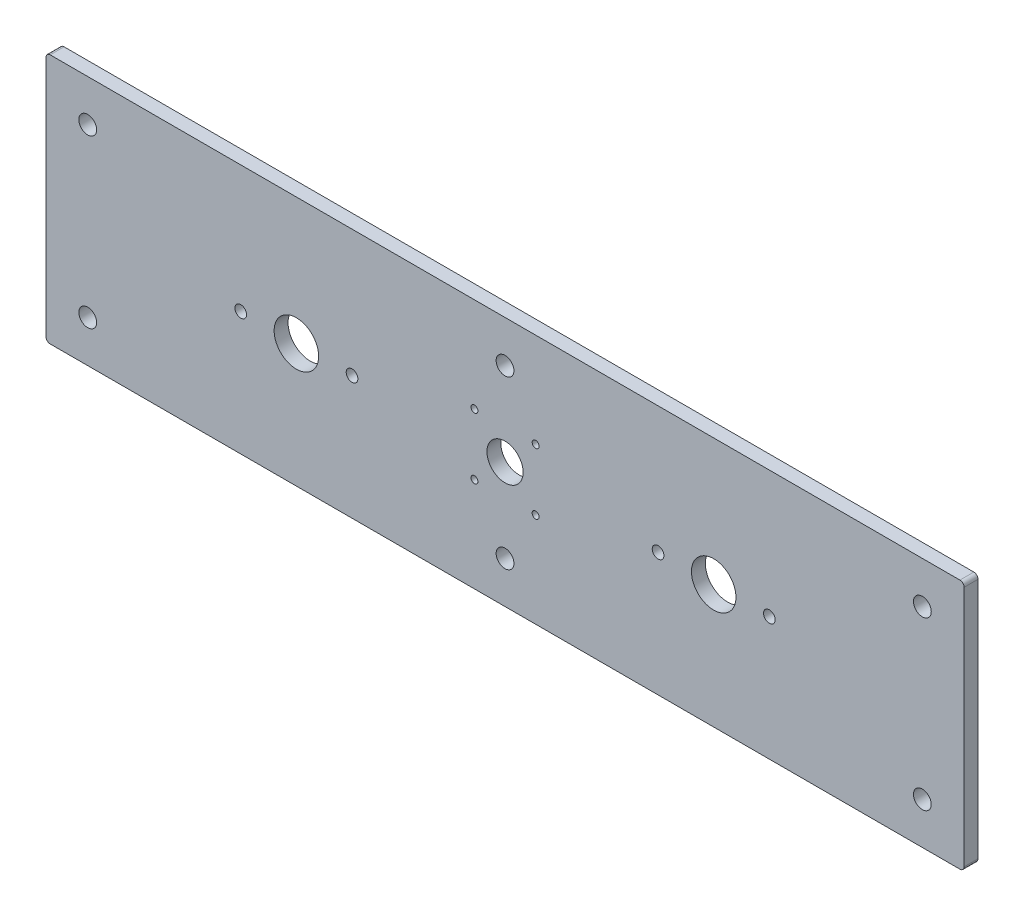
ISO-10303-21;
HEADER;
FILE_DESCRIPTION(('STEP AP214'),'2;1');
FILE_NAME('part.step','',(''),(''),'','','');
FILE_SCHEMA(('AUTOMOTIVE_DESIGN { 1 0 10303 214 1 1 1 1 }'));
ENDSEC;
DATA;
#1=APPLICATION_CONTEXT('core data for automotive mechanical design processes');
#2=APPLICATION_PROTOCOL_DEFINITION('international standard','automotive_design',2000,#1);
#3=PRODUCT_CONTEXT('',#1,'mechanical');
#4=PRODUCT('Part','Part','',(#3));
#5=PRODUCT_RELATED_PRODUCT_CATEGORY('part','',(#4));
#6=PRODUCT_DEFINITION_FORMATION('','',#4);
#7=PRODUCT_DEFINITION_CONTEXT('part definition',#1,'design');
#8=PRODUCT_DEFINITION('design','',#6,#7);
#9=PRODUCT_DEFINITION_SHAPE('','',#8);
#10=(LENGTH_UNIT() NAMED_UNIT(*) SI_UNIT(.MILLI.,.METRE.));
#11=(NAMED_UNIT(*) PLANE_ANGLE_UNIT() SI_UNIT($,.RADIAN.));
#12=(NAMED_UNIT(*) SI_UNIT($,.STERADIAN.) SOLID_ANGLE_UNIT());
#13=UNCERTAINTY_MEASURE_WITH_UNIT(LENGTH_MEASURE(1.E-05),#10,'distance_accuracy_value','');
#14=(GEOMETRIC_REPRESENTATION_CONTEXT(3) GLOBAL_UNCERTAINTY_ASSIGNED_CONTEXT((#13)) GLOBAL_UNIT_ASSIGNED_CONTEXT((#10,
#11,#12)) REPRESENTATION_CONTEXT('',''));
#15=CARTESIAN_POINT('',(0.,0.,0.));
#16=DIRECTION('',(0.,0.,1.));
#17=DIRECTION('',(1.,0.,0.));
#18=AXIS2_PLACEMENT_3D('',#15,#16,#17);
#19=CARTESIAN_POINT('',(0.,0.,2.5));
#20=DIRECTION('',(0.,0.,-1.));
#21=DIRECTION('',(-1.,0.,0.));
#22=AXIS2_PLACEMENT_3D('',#19,#20,#21);
#23=PLANE('',#22);
#24=CARTESIAN_POINT('',(11.,11.,2.5));
#25=DIRECTION('',(0.,0.,1.));
#26=DIRECTION('',(1.,0.,0.));
#27=AXIS2_PLACEMENT_3D('',#24,#25,#26);
#28=CIRCLE('',#27,1.25);
#29=CARTESIAN_POINT('',(12.25,11.,2.5));
#30=VERTEX_POINT('',#29);
#31=EDGE_CURVE('E274',#30,#30,#28,.T.);
#32=ORIENTED_EDGE('',*,*,#31,.F.);
#33=EDGE_LOOP('',(#32));
#34=FACE_BOUND('',#33,.T.);
#35=CARTESIAN_POINT('',(-11.,-11.,2.5));
#36=DIRECTION('',(0.,0.,1.));
#37=DIRECTION('',(1.,0.,0.));
#38=AXIS2_PLACEMENT_3D('',#35,#36,#37);
#39=CIRCLE('',#38,1.25);
#40=CARTESIAN_POINT('',(-9.75,-11.,2.5));
#41=VERTEX_POINT('',#40);
#42=EDGE_CURVE('E268',#41,#41,#39,.T.);
#43=ORIENTED_EDGE('',*,*,#42,.F.);
#44=EDGE_LOOP('',(#43));
#45=FACE_BOUND('',#44,.T.);
#46=CARTESIAN_POINT('',(-11.,11.,2.5));
#47=DIRECTION('',(0.,0.,1.));
#48=DIRECTION('',(1.,0.,0.));
#49=AXIS2_PLACEMENT_3D('',#46,#47,#48);
#50=CIRCLE('',#49,1.25);
#51=CARTESIAN_POINT('',(-9.75,11.,2.5));
#52=VERTEX_POINT('',#51);
#53=EDGE_CURVE('E262',#52,#52,#50,.T.);
#54=ORIENTED_EDGE('',*,*,#53,.F.);
#55=EDGE_LOOP('',(#54));
#56=FACE_BOUND('',#55,.T.);
#57=CARTESIAN_POINT('',(11.,-11.,2.5));
#58=DIRECTION('',(0.,0.,1.));
#59=DIRECTION('',(1.,0.,0.));
#60=AXIS2_PLACEMENT_3D('',#57,#58,#59);
#61=CIRCLE('',#60,1.25);
#62=CARTESIAN_POINT('',(12.25,-11.,2.5));
#63=VERTEX_POINT('',#62);
#64=EDGE_CURVE('E256',#63,#63,#61,.T.);
#65=ORIENTED_EDGE('',*,*,#64,.F.);
#66=EDGE_LOOP('',(#65));
#67=FACE_BOUND('',#66,.T.);
#68=CARTESIAN_POINT('',(0.,0.,2.5));
#69=DIRECTION('',(0.,0.,1.));
#70=DIRECTION('',(1.,0.,0.));
#71=AXIS2_PLACEMENT_3D('',#68,#69,#70);
#72=CIRCLE('',#71,6.5);
#73=CARTESIAN_POINT('',(6.5,0.,2.5));
#74=VERTEX_POINT('',#73);
#75=EDGE_CURVE('E248',#74,#74,#72,.T.);
#76=ORIENTED_EDGE('',*,*,#75,.F.);
#77=EDGE_LOOP('',(#76));
#78=FACE_BOUND('',#77,.T.);
#79=CARTESIAN_POINT('',(95.,-0.6,2.5));
#80=DIRECTION('',(0.,0.,1.));
#81=DIRECTION('',(1.,0.,0.));
#82=AXIS2_PLACEMENT_3D('',#79,#80,#81);
#83=CIRCLE('',#82,2.09999999999999);
#84=CARTESIAN_POINT('',(97.1,-0.6,2.5));
#85=VERTEX_POINT('',#84);
#86=EDGE_CURVE('E244',#85,#85,#83,.T.);
#87=ORIENTED_EDGE('',*,*,#86,.F.);
#88=EDGE_LOOP('',(#87));
#89=FACE_BOUND('',#88,.T.);
#90=CARTESIAN_POINT('',(55.,-0.6,2.5));
#91=DIRECTION('',(0.,0.,1.));
#92=DIRECTION('',(1.,0.,0.));
#93=AXIS2_PLACEMENT_3D('',#90,#91,#92);
#94=CIRCLE('',#93,2.1);
#95=CARTESIAN_POINT('',(57.1,-0.6,2.5));
#96=VERTEX_POINT('',#95);
#97=EDGE_CURVE('E238',#96,#96,#94,.T.);
#98=ORIENTED_EDGE('',*,*,#97,.F.);
#99=EDGE_LOOP('',(#98));
#100=FACE_BOUND('',#99,.T.);
#101=DIRECTION('',(0.,-1.,0.));
#102=VECTOR('',#101,1.);
#103=CARTESIAN_POINT('',(-165.,-45.,2.5));
#104=LINE('',#103,#102);
#105=CARTESIAN_POINT('',(-165.,43.5,2.5));
#106=VERTEX_POINT('',#105);
#107=CARTESIAN_POINT('',(-165.,-43.5,2.5));
#108=VERTEX_POINT('',#107);
#109=EDGE_CURVE('E196',#106,#108,#104,.T.);
#110=ORIENTED_EDGE('',*,*,#109,.T.);
#111=CARTESIAN_POINT('',(-163.5,-43.5,2.5));
#112=DIRECTION('',(0.,0.,-1.));
#113=DIRECTION('',(-1.,0.,0.));
#114=AXIS2_PLACEMENT_3D('',#111,#112,#113);
#115=CIRCLE('',#114,1.5);
#116=CARTESIAN_POINT('',(-163.5,-45.,2.5));
#117=VERTEX_POINT('',#116);
#118=EDGE_CURVE('E175',#108,#117,#115,.F.);
#119=ORIENTED_EDGE('',*,*,#118,.T.);
#120=DIRECTION('',(1.,0.,0.));
#121=VECTOR('',#120,1.);
#122=CARTESIAN_POINT('',(-165.,-45.,2.5));
#123=LINE('',#122,#121);
#124=CARTESIAN_POINT('',(163.5,-45.,2.5));
#125=VERTEX_POINT('',#124);
#126=EDGE_CURVE('E121',#117,#125,#123,.T.);
#127=ORIENTED_EDGE('',*,*,#126,.T.);
#128=CARTESIAN_POINT('',(163.5,-43.5,2.5));
#129=DIRECTION('',(0.,0.,-1.));
#130=DIRECTION('',(-1.,0.,0.));
#131=AXIS2_PLACEMENT_3D('',#128,#129,#130);
#132=CIRCLE('',#131,1.5);
#133=CARTESIAN_POINT('',(165.,-43.5,2.5));
#134=VERTEX_POINT('',#133);
#135=EDGE_CURVE('E171',#125,#134,#132,.F.);
#136=ORIENTED_EDGE('',*,*,#135,.T.);
#137=DIRECTION('',(0.,1.,0.));
#138=VECTOR('',#137,1.);
#139=CARTESIAN_POINT('',(165.,-45.,2.5));
#140=LINE('',#139,#138);
#141=CARTESIAN_POINT('',(165.,43.5,2.5));
#142=VERTEX_POINT('',#141);
#143=EDGE_CURVE('E129',#134,#142,#140,.T.);
#144=ORIENTED_EDGE('',*,*,#143,.T.);
#145=CARTESIAN_POINT('',(163.5,43.5,2.5));
#146=DIRECTION('',(0.,0.,-1.));
#147=DIRECTION('',(-1.,0.,0.));
#148=AXIS2_PLACEMENT_3D('',#145,#146,#147);
#149=CIRCLE('',#148,1.5);
#150=CARTESIAN_POINT('',(163.5,45.,2.5));
#151=VERTEX_POINT('',#150);
#152=EDGE_CURVE('E56',#142,#151,#149,.F.);
#153=ORIENTED_EDGE('',*,*,#152,.T.);
#154=DIRECTION('',(-1.,0.,0.));
#155=VECTOR('',#154,1.);
#156=CARTESIAN_POINT('',(-165.,45.,2.5));
#157=LINE('',#156,#155);
#158=CARTESIAN_POINT('',(-163.5,45.,2.5));
#159=VERTEX_POINT('',#158);
#160=EDGE_CURVE('E132',#151,#159,#157,.T.);
#161=ORIENTED_EDGE('',*,*,#160,.T.);
#162=CARTESIAN_POINT('',(-163.5,43.5,2.5));
#163=DIRECTION('',(0.,0.,-1.));
#164=DIRECTION('',(-1.,0.,0.));
#165=AXIS2_PLACEMENT_3D('',#162,#163,#164);
#166=CIRCLE('',#165,1.5);
#167=EDGE_CURVE('E173',#159,#106,#166,.F.);
#168=ORIENTED_EDGE('',*,*,#167,.T.);
#169=EDGE_LOOP('',(#110,#119,#127,#136,#144,#153,#161,#168));
#170=FACE_BOUND('',#169,.T.);
#171=CARTESIAN_POINT('',(150.000000000003,30.0000000000006,2.5));
#172=DIRECTION('',(0.,0.,1.));
#173=DIRECTION('',(1.,0.,0.));
#174=AXIS2_PLACEMENT_3D('',#171,#172,#173);
#175=CIRCLE('',#174,3.19999999999998);
#176=CARTESIAN_POINT('',(153.200000000003,30.0000000000006,2.5));
#177=VERTEX_POINT('',#176);
#178=EDGE_CURVE('E142',#177,#177,#175,.T.);
#179=ORIENTED_EDGE('',*,*,#178,.F.);
#180=EDGE_LOOP('',(#179));
#181=FACE_BOUND('',#180,.T.);
#182=CARTESIAN_POINT('',(150.000000000003,-30.0000000000006,2.5));
#183=DIRECTION('',(0.,0.,1.));
#184=DIRECTION('',(1.,0.,0.));
#185=AXIS2_PLACEMENT_3D('',#182,#183,#184);
#186=CIRCLE('',#185,3.19999999999998);
#187=CARTESIAN_POINT('',(153.200000000003,-30.0000000000006,2.5));
#188=VERTEX_POINT('',#187);
#189=EDGE_CURVE('E146',#188,#188,#186,.T.);
#190=ORIENTED_EDGE('',*,*,#189,.F.);
#191=EDGE_LOOP('',(#190));
#192=FACE_BOUND('',#191,.T.);
#193=CARTESIAN_POINT('',(0.,-30.0000000000006,2.5));
#194=DIRECTION('',(0.,0.,1.));
#195=DIRECTION('',(1.,0.,0.));
#196=AXIS2_PLACEMENT_3D('',#193,#194,#195);
#197=CIRCLE('',#196,3.19999999999999);
#198=CARTESIAN_POINT('',(3.20000000000004,-30.0000000000006,2.5));
#199=VERTEX_POINT('',#198);
#200=EDGE_CURVE('E150',#199,#199,#197,.T.);
#201=ORIENTED_EDGE('',*,*,#200,.F.);
#202=EDGE_LOOP('',(#201));
#203=FACE_BOUND('',#202,.T.);
#204=CARTESIAN_POINT('',(0.,30.0000000000006,2.5));
#205=DIRECTION('',(0.,0.,1.));
#206=DIRECTION('',(1.,0.,0.));
#207=AXIS2_PLACEMENT_3D('',#204,#205,#206);
#208=CIRCLE('',#207,3.19999999999999);
#209=CARTESIAN_POINT('',(3.19999999999994,30.0000000000006,2.5));
#210=VERTEX_POINT('',#209);
#211=EDGE_CURVE('E154',#210,#210,#208,.T.);
#212=ORIENTED_EDGE('',*,*,#211,.F.);
#213=EDGE_LOOP('',(#212));
#214=FACE_BOUND('',#213,.T.);
#215=CARTESIAN_POINT('',(-150.000000000003,-30.0000000000006,2.5));
#216=DIRECTION('',(0.,0.,1.));
#217=DIRECTION('',(1.,0.,0.));
#218=AXIS2_PLACEMENT_3D('',#215,#216,#217);
#219=CIRCLE('',#218,3.19999999999998);
#220=CARTESIAN_POINT('',(-146.800000000003,-30.0000000000006,2.5));
#221=VERTEX_POINT('',#220);
#222=EDGE_CURVE('E158',#221,#221,#219,.T.);
#223=ORIENTED_EDGE('',*,*,#222,.F.);
#224=EDGE_LOOP('',(#223));
#225=FACE_BOUND('',#224,.T.);
#226=CARTESIAN_POINT('',(-150.000000000003,30.0000000000006,2.5));
#227=DIRECTION('',(0.,0.,1.));
#228=DIRECTION('',(1.,0.,0.));
#229=AXIS2_PLACEMENT_3D('',#226,#227,#228);
#230=CIRCLE('',#229,3.19999999999998);
#231=CARTESIAN_POINT('',(-146.800000000003,30.0000000000006,2.5));
#232=VERTEX_POINT('',#231);
#233=EDGE_CURVE('E162',#232,#232,#230,.T.);
#234=ORIENTED_EDGE('',*,*,#233,.F.);
#235=EDGE_LOOP('',(#234));
#236=FACE_BOUND('',#235,.T.);
#237=CARTESIAN_POINT('',(-75.,-0.6,2.5));
#238=DIRECTION('',(0.,0.,1.));
#239=DIRECTION('',(1.,0.,0.));
#240=AXIS2_PLACEMENT_3D('',#237,#238,#239);
#241=CIRCLE('',#240,8.);
#242=CARTESIAN_POINT('',(-67.,-0.6,2.5));
#243=VERTEX_POINT('',#242);
#244=EDGE_CURVE('E212',#243,#243,#241,.T.);
#245=ORIENTED_EDGE('',*,*,#244,.F.);
#246=EDGE_LOOP('',(#245));
#247=FACE_BOUND('',#246,.T.);
#248=CARTESIAN_POINT('',(-55.,-0.6,2.5));
#249=DIRECTION('',(0.,0.,1.));
#250=DIRECTION('',(1.,0.,0.));
#251=AXIS2_PLACEMENT_3D('',#248,#249,#250);
#252=CIRCLE('',#251,2.1);
#253=CARTESIAN_POINT('',(-52.9,-0.6,2.5));
#254=VERTEX_POINT('',#253);
#255=EDGE_CURVE('E220',#254,#254,#252,.T.);
#256=ORIENTED_EDGE('',*,*,#255,.F.);
#257=EDGE_LOOP('',(#256));
#258=FACE_BOUND('',#257,.T.);
#259=CARTESIAN_POINT('',(-95.,-0.6,2.5));
#260=DIRECTION('',(0.,0.,1.));
#261=DIRECTION('',(1.,0.,0.));
#262=AXIS2_PLACEMENT_3D('',#259,#260,#261);
#263=CIRCLE('',#262,2.09999999999999);
#264=CARTESIAN_POINT('',(-92.9,-0.6,2.5));
#265=VERTEX_POINT('',#264);
#266=EDGE_CURVE('E226',#265,#265,#263,.T.);
#267=ORIENTED_EDGE('',*,*,#266,.F.);
#268=EDGE_LOOP('',(#267));
#269=FACE_BOUND('',#268,.T.);
#270=CARTESIAN_POINT('',(75.,-0.6,2.5));
#271=DIRECTION('',(0.,0.,-1.));
#272=DIRECTION('',(-1.,0.,0.));
#273=AXIS2_PLACEMENT_3D('',#270,#271,#272);
#274=CIRCLE('',#273,8.);
#275=CARTESIAN_POINT('',(67.,-0.6,2.5));
#276=VERTEX_POINT('',#275);
#277=EDGE_CURVE('E230',#276,#276,#274,.T.);
#278=ORIENTED_EDGE('',*,*,#277,.T.);
#279=EDGE_LOOP('',(#278));
#280=FACE_BOUND('',#279,.T.);
#281=ADVANCED_FACE('F34',(#34,#45,#56,#67,#78,#89,#100,#170,#181,#192,#203,#214,#225,#236,#247,
#258,#269,#280),#23,.F.);
#282=CARTESIAN_POINT('',(0.,0.,-2.5));
#283=DIRECTION('',(0.,0.,-1.));
#284=DIRECTION('',(-1.,0.,0.));
#285=AXIS2_PLACEMENT_3D('',#282,#283,#284);
#286=PLANE('',#285);
#287=CARTESIAN_POINT('',(11.,11.,-2.5));
#288=DIRECTION('',(0.,0.,1.));
#289=DIRECTION('',(1.,0.,0.));
#290=AXIS2_PLACEMENT_3D('',#287,#288,#289);
#291=CIRCLE('',#290,1.25);
#292=CARTESIAN_POINT('',(12.25,11.,-2.5));
#293=VERTEX_POINT('',#292);
#294=EDGE_CURVE('E271',#293,#293,#291,.T.);
#295=ORIENTED_EDGE('',*,*,#294,.T.);
#296=EDGE_LOOP('',(#295));
#297=FACE_BOUND('',#296,.T.);
#298=CARTESIAN_POINT('',(-11.,-11.,-2.5));
#299=DIRECTION('',(0.,0.,1.));
#300=DIRECTION('',(1.,0.,0.));
#301=AXIS2_PLACEMENT_3D('',#298,#299,#300);
#302=CIRCLE('',#301,1.25);
#303=CARTESIAN_POINT('',(-9.75,-11.,-2.5));
#304=VERTEX_POINT('',#303);
#305=EDGE_CURVE('E265',#304,#304,#302,.T.);
#306=ORIENTED_EDGE('',*,*,#305,.T.);
#307=EDGE_LOOP('',(#306));
#308=FACE_BOUND('',#307,.T.);
#309=CARTESIAN_POINT('',(-11.,11.,-2.5));
#310=DIRECTION('',(0.,0.,1.));
#311=DIRECTION('',(1.,0.,0.));
#312=AXIS2_PLACEMENT_3D('',#309,#310,#311);
#313=CIRCLE('',#312,1.25);
#314=CARTESIAN_POINT('',(-9.75,11.,-2.5));
#315=VERTEX_POINT('',#314);
#316=EDGE_CURVE('E259',#315,#315,#313,.T.);
#317=ORIENTED_EDGE('',*,*,#316,.T.);
#318=EDGE_LOOP('',(#317));
#319=FACE_BOUND('',#318,.T.);
#320=CARTESIAN_POINT('',(11.,-11.,-2.5));
#321=DIRECTION('',(0.,0.,1.));
#322=DIRECTION('',(1.,0.,0.));
#323=AXIS2_PLACEMENT_3D('',#320,#321,#322);
#324=CIRCLE('',#323,1.25);
#325=CARTESIAN_POINT('',(12.25,-11.,-2.5));
#326=VERTEX_POINT('',#325);
#327=EDGE_CURVE('E251',#326,#326,#324,.T.);
#328=ORIENTED_EDGE('',*,*,#327,.T.);
#329=EDGE_LOOP('',(#328));
#330=FACE_BOUND('',#329,.T.);
#331=CARTESIAN_POINT('',(0.,0.,-2.5));
#332=DIRECTION('',(0.,0.,1.));
#333=DIRECTION('',(1.,0.,0.));
#334=AXIS2_PLACEMENT_3D('',#331,#332,#333);
#335=CIRCLE('',#334,6.5);
#336=CARTESIAN_POINT('',(6.5,0.,-2.5));
#337=VERTEX_POINT('',#336);
#338=EDGE_CURVE('E247',#337,#337,#335,.T.);
#339=ORIENTED_EDGE('',*,*,#338,.T.);
#340=EDGE_LOOP('',(#339));
#341=FACE_BOUND('',#340,.T.);
#342=CARTESIAN_POINT('',(95.,-0.6,-2.5));
#343=DIRECTION('',(0.,0.,1.));
#344=DIRECTION('',(1.,0.,0.));
#345=AXIS2_PLACEMENT_3D('',#342,#343,#344);
#346=CIRCLE('',#345,2.09999999999999);
#347=CARTESIAN_POINT('',(97.1,-0.6,-2.5));
#348=VERTEX_POINT('',#347);
#349=EDGE_CURVE('E241',#348,#348,#346,.T.);
#350=ORIENTED_EDGE('',*,*,#349,.T.);
#351=EDGE_LOOP('',(#350));
#352=FACE_BOUND('',#351,.T.);
#353=CARTESIAN_POINT('',(55.,-0.6,-2.5));
#354=DIRECTION('',(0.,0.,1.));
#355=DIRECTION('',(1.,0.,0.));
#356=AXIS2_PLACEMENT_3D('',#353,#354,#355);
#357=CIRCLE('',#356,2.1);
#358=CARTESIAN_POINT('',(57.1,-0.6,-2.5));
#359=VERTEX_POINT('',#358);
#360=EDGE_CURVE('E233',#359,#359,#357,.T.);
#361=ORIENTED_EDGE('',*,*,#360,.T.);
#362=EDGE_LOOP('',(#361));
#363=FACE_BOUND('',#362,.T.);
#364=DIRECTION('',(1.,0.,0.));
#365=VECTOR('',#364,1.);
#366=CARTESIAN_POINT('',(-165.,-45.,-2.5));
#367=LINE('',#366,#365);
#368=CARTESIAN_POINT('',(-163.5,-45.,-2.5));
#369=VERTEX_POINT('',#368);
#370=CARTESIAN_POINT('',(163.5,-45.,-2.5));
#371=VERTEX_POINT('',#370);
#372=EDGE_CURVE('E118',#369,#371,#367,.T.);
#373=ORIENTED_EDGE('',*,*,#372,.F.);
#374=CARTESIAN_POINT('',(-163.5,-43.5,-2.5));
#375=DIRECTION('',(0.,0.,-1.));
#376=DIRECTION('',(-1.,0.,0.));
#377=AXIS2_PLACEMENT_3D('',#374,#375,#376);
#378=CIRCLE('',#377,1.5);
#379=CARTESIAN_POINT('',(-165.,-43.5,-2.5));
#380=VERTEX_POINT('',#379);
#381=EDGE_CURVE('E101',#369,#380,#378,.T.);
#382=ORIENTED_EDGE('',*,*,#381,.T.);
#383=DIRECTION('',(0.,-1.,0.));
#384=VECTOR('',#383,1.);
#385=CARTESIAN_POINT('',(-165.,-45.,-2.5));
#386=LINE('',#385,#384);
#387=CARTESIAN_POINT('',(-165.,43.5,-2.5));
#388=VERTEX_POINT('',#387);
#389=EDGE_CURVE('E130',#388,#380,#386,.T.);
#390=ORIENTED_EDGE('',*,*,#389,.F.);
#391=CARTESIAN_POINT('',(-163.5,43.5,-2.5));
#392=DIRECTION('',(0.,0.,-1.));
#393=DIRECTION('',(-1.,0.,0.));
#394=AXIS2_PLACEMENT_3D('',#391,#392,#393);
#395=CIRCLE('',#394,1.5);
#396=CARTESIAN_POINT('',(-163.5,45.,-2.5));
#397=VERTEX_POINT('',#396);
#398=EDGE_CURVE('E112',#388,#397,#395,.T.);
#399=ORIENTED_EDGE('',*,*,#398,.T.);
#400=DIRECTION('',(-1.,0.,0.));
#401=VECTOR('',#400,1.);
#402=CARTESIAN_POINT('',(-165.,45.,-2.5));
#403=LINE('',#402,#401);
#404=CARTESIAN_POINT('',(163.5,45.,-2.5));
#405=VERTEX_POINT('',#404);
#406=EDGE_CURVE('E134',#405,#397,#403,.T.);
#407=ORIENTED_EDGE('',*,*,#406,.F.);
#408=CARTESIAN_POINT('',(163.5,43.5,-2.5));
#409=DIRECTION('',(0.,0.,-1.));
#410=DIRECTION('',(-1.,0.,0.));
#411=AXIS2_PLACEMENT_3D('',#408,#409,#410);
#412=CIRCLE('',#411,1.5);
#413=CARTESIAN_POINT('',(165.,43.5,-2.5));
#414=VERTEX_POINT('',#413);
#415=EDGE_CURVE('E122',#405,#414,#412,.T.);
#416=ORIENTED_EDGE('',*,*,#415,.T.);
#417=DIRECTION('',(0.,1.,0.));
#418=VECTOR('',#417,1.);
#419=CARTESIAN_POINT('',(165.,-45.,-2.5));
#420=LINE('',#419,#418);
#421=CARTESIAN_POINT('',(165.,-43.5,-2.5));
#422=VERTEX_POINT('',#421);
#423=EDGE_CURVE('E141',#422,#414,#420,.T.);
#424=ORIENTED_EDGE('',*,*,#423,.F.);
#425=CARTESIAN_POINT('',(163.5,-43.5,-2.5));
#426=DIRECTION('',(0.,0.,-1.));
#427=DIRECTION('',(-1.,0.,0.));
#428=AXIS2_PLACEMENT_3D('',#425,#426,#427);
#429=CIRCLE('',#428,1.5);
#430=EDGE_CURVE('E128',#422,#371,#429,.T.);
#431=ORIENTED_EDGE('',*,*,#430,.T.);
#432=EDGE_LOOP('',(#373,#382,#390,#399,#407,#416,#424,#431));
#433=FACE_BOUND('',#432,.T.);
#434=CARTESIAN_POINT('',(150.000000000003,30.0000000000006,-2.5));
#435=DIRECTION('',(0.,0.,-1.));
#436=DIRECTION('',(-1.,0.,0.));
#437=AXIS2_PLACEMENT_3D('',#434,#435,#436);
#438=CIRCLE('',#437,3.19999999999998);
#439=CARTESIAN_POINT('',(146.800000000003,30.0000000000006,-2.5));
#440=VERTEX_POINT('',#439);
#441=EDGE_CURVE('E138',#440,#440,#438,.T.);
#442=ORIENTED_EDGE('',*,*,#441,.F.);
#443=EDGE_LOOP('',(#442));
#444=FACE_BOUND('',#443,.T.);
#445=CARTESIAN_POINT('',(150.000000000003,-30.0000000000006,-2.5));
#446=DIRECTION('',(0.,0.,-1.));
#447=DIRECTION('',(-1.,0.,0.));
#448=AXIS2_PLACEMENT_3D('',#445,#446,#447);
#449=CIRCLE('',#448,3.19999999999998);
#450=CARTESIAN_POINT('',(146.800000000003,-30.0000000000006,-2.5));
#451=VERTEX_POINT('',#450);
#452=EDGE_CURVE('E143',#451,#451,#449,.T.);
#453=ORIENTED_EDGE('',*,*,#452,.F.);
#454=EDGE_LOOP('',(#453));
#455=FACE_BOUND('',#454,.T.);
#456=CARTESIAN_POINT('',(0.,-30.0000000000006,-2.5));
#457=DIRECTION('',(0.,0.,-1.));
#458=DIRECTION('',(-1.,0.,0.));
#459=AXIS2_PLACEMENT_3D('',#456,#457,#458);
#460=CIRCLE('',#459,3.19999999999999);
#461=CARTESIAN_POINT('',(-3.19999999999994,-30.0000000000006,-2.5));
#462=VERTEX_POINT('',#461);
#463=EDGE_CURVE('E147',#462,#462,#460,.T.);
#464=ORIENTED_EDGE('',*,*,#463,.F.);
#465=EDGE_LOOP('',(#464));
#466=FACE_BOUND('',#465,.T.);
#467=CARTESIAN_POINT('',(0.,30.0000000000006,-2.5));
#468=DIRECTION('',(0.,0.,-1.));
#469=DIRECTION('',(-1.,0.,0.));
#470=AXIS2_PLACEMENT_3D('',#467,#468,#469);
#471=CIRCLE('',#470,3.19999999999999);
#472=CARTESIAN_POINT('',(-3.20000000000004,30.0000000000006,-2.5));
#473=VERTEX_POINT('',#472);
#474=EDGE_CURVE('E151',#473,#473,#471,.T.);
#475=ORIENTED_EDGE('',*,*,#474,.F.);
#476=EDGE_LOOP('',(#475));
#477=FACE_BOUND('',#476,.T.);
#478=CARTESIAN_POINT('',(-150.000000000003,-30.0000000000006,-2.5));
#479=DIRECTION('',(0.,0.,-1.));
#480=DIRECTION('',(-1.,0.,0.));
#481=AXIS2_PLACEMENT_3D('',#478,#479,#480);
#482=CIRCLE('',#481,3.19999999999998);
#483=CARTESIAN_POINT('',(-153.200000000003,-30.0000000000006,-2.5));
#484=VERTEX_POINT('',#483);
#485=EDGE_CURVE('E155',#484,#484,#482,.T.);
#486=ORIENTED_EDGE('',*,*,#485,.F.);
#487=EDGE_LOOP('',(#486));
#488=FACE_BOUND('',#487,.T.);
#489=CARTESIAN_POINT('',(-150.000000000003,30.0000000000006,-2.5));
#490=DIRECTION('',(0.,0.,-1.));
#491=DIRECTION('',(-1.,0.,0.));
#492=AXIS2_PLACEMENT_3D('',#489,#490,#491);
#493=CIRCLE('',#492,3.19999999999998);
#494=CARTESIAN_POINT('',(-153.200000000003,30.0000000000006,-2.5));
#495=VERTEX_POINT('',#494);
#496=EDGE_CURVE('E159',#495,#495,#493,.T.);
#497=ORIENTED_EDGE('',*,*,#496,.F.);
#498=EDGE_LOOP('',(#497));
#499=FACE_BOUND('',#498,.T.);
#500=CARTESIAN_POINT('',(-75.,-0.6,-2.5));
#501=DIRECTION('',(0.,0.,1.));
#502=DIRECTION('',(1.,0.,0.));
#503=AXIS2_PLACEMENT_3D('',#500,#501,#502);
#504=CIRCLE('',#503,8.);
#505=CARTESIAN_POINT('',(-67.,-0.6,-2.5));
#506=VERTEX_POINT('',#505);
#507=EDGE_CURVE('E211',#506,#506,#504,.T.);
#508=ORIENTED_EDGE('',*,*,#507,.T.);
#509=EDGE_LOOP('',(#508));
#510=FACE_BOUND('',#509,.T.);
#511=CARTESIAN_POINT('',(-55.,-0.6,-2.5));
#512=DIRECTION('',(0.,0.,1.));
#513=DIRECTION('',(1.,0.,0.));
#514=AXIS2_PLACEMENT_3D('',#511,#512,#513);
#515=CIRCLE('',#514,2.1);
#516=CARTESIAN_POINT('',(-52.9,-0.6,-2.5));
#517=VERTEX_POINT('',#516);
#518=EDGE_CURVE('E215',#517,#517,#515,.T.);
#519=ORIENTED_EDGE('',*,*,#518,.T.);
#520=EDGE_LOOP('',(#519));
#521=FACE_BOUND('',#520,.T.);
#522=CARTESIAN_POINT('',(-95.,-0.6,-2.5));
#523=DIRECTION('',(0.,0.,1.));
#524=DIRECTION('',(1.,0.,0.));
#525=AXIS2_PLACEMENT_3D('',#522,#523,#524);
#526=CIRCLE('',#525,2.09999999999999);
#527=CARTESIAN_POINT('',(-92.9,-0.6,-2.5));
#528=VERTEX_POINT('',#527);
#529=EDGE_CURVE('E223',#528,#528,#526,.T.);
#530=ORIENTED_EDGE('',*,*,#529,.T.);
#531=EDGE_LOOP('',(#530));
#532=FACE_BOUND('',#531,.T.);
#533=CARTESIAN_POINT('',(75.,-0.6,-2.5));
#534=DIRECTION('',(0.,0.,-1.));
#535=DIRECTION('',(-1.,0.,0.));
#536=AXIS2_PLACEMENT_3D('',#533,#534,#535);
#537=CIRCLE('',#536,8.);
#538=CARTESIAN_POINT('',(67.,-0.6,-2.5));
#539=VERTEX_POINT('',#538);
#540=EDGE_CURVE('E229',#539,#539,#537,.T.);
#541=ORIENTED_EDGE('',*,*,#540,.F.);
#542=EDGE_LOOP('',(#541));
#543=FACE_BOUND('',#542,.T.);
#544=ADVANCED_FACE('F125',(#297,#308,#319,#330,#341,#352,#363,#433,#444,#455,#466,#477,#488,
#499,#510,#521,#532,#543),#286,.T.);
#545=CARTESIAN_POINT('',(165.,-45.,2.5));
#546=DIRECTION('',(-1.,0.,0.));
#547=DIRECTION('',(0.,0.,1.));
#548=AXIS2_PLACEMENT_3D('',#545,#546,#547);
#549=PLANE('',#548);
#550=ORIENTED_EDGE('',*,*,#143,.F.);
#551=DIRECTION('',(0.,0.,-1.));
#552=VECTOR('',#551,1.);
#553=CARTESIAN_POINT('',(165.,-43.5,2.5));
#554=LINE('',#553,#552);
#555=EDGE_CURVE('E11',#134,#422,#554,.T.);
#556=ORIENTED_EDGE('',*,*,#555,.T.);
#557=ORIENTED_EDGE('',*,*,#423,.T.);
#558=DIRECTION('',(0.,0.,-1.));
#559=VECTOR('',#558,1.);
#560=CARTESIAN_POINT('',(165.,43.5,2.5));
#561=LINE('',#560,#559);
#562=EDGE_CURVE('E42',#414,#142,#561,.F.);
#563=ORIENTED_EDGE('',*,*,#562,.T.);
#564=EDGE_LOOP('',(#550,#556,#557,#563));
#565=FACE_BOUND('',#564,.T.);
#566=ADVANCED_FACE('F184',(#565),#549,.F.);
#567=CARTESIAN_POINT('',(-165.,45.,2.5));
#568=DIRECTION('',(0.,-1.,0.));
#569=DIRECTION('',(0.,0.,-1.));
#570=AXIS2_PLACEMENT_3D('',#567,#568,#569);
#571=PLANE('',#570);
#572=ORIENTED_EDGE('',*,*,#406,.T.);
#573=DIRECTION('',(0.,0.,-1.));
#574=VECTOR('',#573,1.);
#575=CARTESIAN_POINT('',(-163.5,45.,2.5));
#576=LINE('',#575,#574);
#577=EDGE_CURVE('E49',#397,#159,#576,.F.);
#578=ORIENTED_EDGE('',*,*,#577,.T.);
#579=ORIENTED_EDGE('',*,*,#160,.F.);
#580=DIRECTION('',(0.,0.,-1.));
#581=VECTOR('',#580,1.);
#582=CARTESIAN_POINT('',(163.5,45.,2.5));
#583=LINE('',#582,#581);
#584=EDGE_CURVE('E177',#151,#405,#583,.T.);
#585=ORIENTED_EDGE('',*,*,#584,.T.);
#586=EDGE_LOOP('',(#572,#578,#579,#585));
#587=FACE_BOUND('',#586,.T.);
#588=ADVANCED_FACE('F192',(#587),#571,.F.);
#589=CARTESIAN_POINT('',(-165.,-45.,2.5));
#590=DIRECTION('',(1.,0.,0.));
#591=DIRECTION('',(0.,0.,-1.));
#592=AXIS2_PLACEMENT_3D('',#589,#590,#591);
#593=PLANE('',#592);
#594=ORIENTED_EDGE('',*,*,#389,.T.);
#595=DIRECTION('',(0.,0.,-1.));
#596=VECTOR('',#595,1.);
#597=CARTESIAN_POINT('',(-165.,-43.5,2.5));
#598=LINE('',#597,#596);
#599=EDGE_CURVE('E106',#380,#108,#598,.F.);
#600=ORIENTED_EDGE('',*,*,#599,.T.);
#601=ORIENTED_EDGE('',*,*,#109,.F.);
#602=DIRECTION('',(0.,0.,-1.));
#603=VECTOR('',#602,1.);
#604=CARTESIAN_POINT('',(-165.,43.5,2.5));
#605=LINE('',#604,#603);
#606=EDGE_CURVE('E111',#106,#388,#605,.T.);
#607=ORIENTED_EDGE('',*,*,#606,.T.);
#608=EDGE_LOOP('',(#594,#600,#601,#607));
#609=FACE_BOUND('',#608,.T.);
#610=ADVANCED_FACE('F354',(#609),#593,.F.);
#611=CARTESIAN_POINT('',(-165.,-45.,2.5));
#612=DIRECTION('',(0.,1.,0.));
#613=DIRECTION('',(0.,0.,1.));
#614=AXIS2_PLACEMENT_3D('',#611,#612,#613);
#615=PLANE('',#614);
#616=ORIENTED_EDGE('',*,*,#126,.F.);
#617=DIRECTION('',(0.,0.,-1.));
#618=VECTOR('',#617,1.);
#619=CARTESIAN_POINT('',(-163.5,-45.,2.5));
#620=LINE('',#619,#618);
#621=EDGE_CURVE('E105',#117,#369,#620,.T.);
#622=ORIENTED_EDGE('',*,*,#621,.T.);
#623=ORIENTED_EDGE('',*,*,#372,.T.);
#624=DIRECTION('',(0.,0.,-1.));
#625=VECTOR('',#624,1.);
#626=CARTESIAN_POINT('',(163.5,-45.,2.5));
#627=LINE('',#626,#625);
#628=EDGE_CURVE('E123',#371,#125,#627,.F.);
#629=ORIENTED_EDGE('',*,*,#628,.T.);
#630=EDGE_LOOP('',(#616,#622,#623,#629));
#631=FACE_BOUND('',#630,.T.);
#632=ADVANCED_FACE('F117',(#631),#615,.F.);
#633=CARTESIAN_POINT('',(150.000000000003,30.0000000000006,2.5));
#634=DIRECTION('',(0.,0.,1.));
#635=DIRECTION('',(1.,0.,0.));
#636=AXIS2_PLACEMENT_3D('',#633,#634,#635);
#637=CYLINDRICAL_SURFACE('',#636,3.19999999999998);
#638=ORIENTED_EDGE('',*,*,#441,.T.);
#639=EDGE_LOOP('',(#638));
#640=FACE_BOUND('',#639,.T.);
#641=ORIENTED_EDGE('',*,*,#178,.T.);
#642=EDGE_LOOP('',(#641));
#643=FACE_BOUND('',#642,.T.);
#644=ADVANCED_FACE('F344',(#640,#643),#637,.F.);
#645=CARTESIAN_POINT('',(150.000000000003,-30.0000000000006,2.5));
#646=DIRECTION('',(0.,0.,1.));
#647=DIRECTION('',(1.,0.,0.));
#648=AXIS2_PLACEMENT_3D('',#645,#646,#647);
#649=CYLINDRICAL_SURFACE('',#648,3.19999999999998);
#650=ORIENTED_EDGE('',*,*,#452,.T.);
#651=EDGE_LOOP('',(#650));
#652=FACE_BOUND('',#651,.T.);
#653=ORIENTED_EDGE('',*,*,#189,.T.);
#654=EDGE_LOOP('',(#653));
#655=FACE_BOUND('',#654,.T.);
#656=ADVANCED_FACE('F340',(#652,#655),#649,.F.);
#657=CARTESIAN_POINT('',(0.,-30.0000000000006,2.5));
#658=DIRECTION('',(0.,0.,1.));
#659=DIRECTION('',(1.,0.,0.));
#660=AXIS2_PLACEMENT_3D('',#657,#658,#659);
#661=CYLINDRICAL_SURFACE('',#660,3.19999999999999);
#662=ORIENTED_EDGE('',*,*,#463,.T.);
#663=EDGE_LOOP('',(#662));
#664=FACE_BOUND('',#663,.T.);
#665=ORIENTED_EDGE('',*,*,#200,.T.);
#666=EDGE_LOOP('',(#665));
#667=FACE_BOUND('',#666,.T.);
#668=ADVANCED_FACE('F336',(#664,#667),#661,.F.);
#669=CARTESIAN_POINT('',(0.,30.0000000000006,2.5));
#670=DIRECTION('',(0.,0.,1.));
#671=DIRECTION('',(1.,0.,0.));
#672=AXIS2_PLACEMENT_3D('',#669,#670,#671);
#673=CYLINDRICAL_SURFACE('',#672,3.19999999999999);
#674=ORIENTED_EDGE('',*,*,#474,.T.);
#675=EDGE_LOOP('',(#674));
#676=FACE_BOUND('',#675,.T.);
#677=ORIENTED_EDGE('',*,*,#211,.T.);
#678=EDGE_LOOP('',(#677));
#679=FACE_BOUND('',#678,.T.);
#680=ADVANCED_FACE('F332',(#676,#679),#673,.F.);
#681=CARTESIAN_POINT('',(-150.000000000003,-30.0000000000006,2.5));
#682=DIRECTION('',(0.,0.,1.));
#683=DIRECTION('',(1.,0.,0.));
#684=AXIS2_PLACEMENT_3D('',#681,#682,#683);
#685=CYLINDRICAL_SURFACE('',#684,3.19999999999998);
#686=ORIENTED_EDGE('',*,*,#485,.T.);
#687=EDGE_LOOP('',(#686));
#688=FACE_BOUND('',#687,.T.);
#689=ORIENTED_EDGE('',*,*,#222,.T.);
#690=EDGE_LOOP('',(#689));
#691=FACE_BOUND('',#690,.T.);
#692=ADVANCED_FACE('F328',(#688,#691),#685,.F.);
#693=CARTESIAN_POINT('',(-150.000000000003,30.0000000000006,2.5));
#694=DIRECTION('',(0.,0.,1.));
#695=DIRECTION('',(1.,0.,0.));
#696=AXIS2_PLACEMENT_3D('',#693,#694,#695);
#697=CYLINDRICAL_SURFACE('',#696,3.19999999999998);
#698=ORIENTED_EDGE('',*,*,#496,.T.);
#699=EDGE_LOOP('',(#698));
#700=FACE_BOUND('',#699,.T.);
#701=ORIENTED_EDGE('',*,*,#233,.T.);
#702=EDGE_LOOP('',(#701));
#703=FACE_BOUND('',#702,.T.);
#704=ADVANCED_FACE('F324',(#700,#703),#697,.F.);
#705=CARTESIAN_POINT('',(-75.,-0.6,-2.5));
#706=DIRECTION('',(0.,0.,1.));
#707=DIRECTION('',(1.,0.,0.));
#708=AXIS2_PLACEMENT_3D('',#705,#706,#707);
#709=CYLINDRICAL_SURFACE('',#708,8.);
#710=ORIENTED_EDGE('',*,*,#507,.F.);
#711=EDGE_LOOP('',(#710));
#712=FACE_BOUND('',#711,.T.);
#713=ORIENTED_EDGE('',*,*,#244,.T.);
#714=EDGE_LOOP('',(#713));
#715=FACE_BOUND('',#714,.T.);
#716=ADVANCED_FACE('F320',(#712,#715),#709,.F.);
#717=CARTESIAN_POINT('',(-55.,-0.6,2.5));
#718=DIRECTION('',(0.,0.,1.));
#719=DIRECTION('',(1.,0.,0.));
#720=AXIS2_PLACEMENT_3D('',#717,#718,#719);
#721=CYLINDRICAL_SURFACE('',#720,2.1);
#722=ORIENTED_EDGE('',*,*,#518,.F.);
#723=EDGE_LOOP('',(#722));
#724=FACE_BOUND('',#723,.T.);
#725=ORIENTED_EDGE('',*,*,#255,.T.);
#726=EDGE_LOOP('',(#725));
#727=FACE_BOUND('',#726,.T.);
#728=ADVANCED_FACE('F316',(#724,#727),#721,.F.);
#729=CARTESIAN_POINT('',(-95.,-0.6,2.5));
#730=DIRECTION('',(0.,0.,1.));
#731=DIRECTION('',(1.,0.,0.));
#732=AXIS2_PLACEMENT_3D('',#729,#730,#731);
#733=CYLINDRICAL_SURFACE('',#732,2.09999999999999);
#734=ORIENTED_EDGE('',*,*,#529,.F.);
#735=EDGE_LOOP('',(#734));
#736=FACE_BOUND('',#735,.T.);
#737=ORIENTED_EDGE('',*,*,#266,.T.);
#738=EDGE_LOOP('',(#737));
#739=FACE_BOUND('',#738,.T.);
#740=ADVANCED_FACE('F308',(#736,#739),#733,.F.);
#741=CARTESIAN_POINT('',(75.,-0.6,-2.5));
#742=DIRECTION('',(0.,0.,1.));
#743=DIRECTION('',(1.,0.,0.));
#744=AXIS2_PLACEMENT_3D('',#741,#742,#743);
#745=CYLINDRICAL_SURFACE('',#744,8.);
#746=ORIENTED_EDGE('',*,*,#540,.T.);
#747=EDGE_LOOP('',(#746));
#748=FACE_BOUND('',#747,.T.);
#749=ORIENTED_EDGE('',*,*,#277,.F.);
#750=EDGE_LOOP('',(#749));
#751=FACE_BOUND('',#750,.T.);
#752=ADVANCED_FACE('F298',(#748,#751),#745,.F.);
#753=CARTESIAN_POINT('',(55.,-0.6,2.5));
#754=DIRECTION('',(0.,0.,1.));
#755=DIRECTION('',(1.,0.,0.));
#756=AXIS2_PLACEMENT_3D('',#753,#754,#755);
#757=CYLINDRICAL_SURFACE('',#756,2.1);
#758=ORIENTED_EDGE('',*,*,#360,.F.);
#759=EDGE_LOOP('',(#758));
#760=FACE_BOUND('',#759,.T.);
#761=ORIENTED_EDGE('',*,*,#97,.T.);
#762=EDGE_LOOP('',(#761));
#763=FACE_BOUND('',#762,.T.);
#764=ADVANCED_FACE('F295',(#760,#763),#757,.F.);
#765=CARTESIAN_POINT('',(95.,-0.6,2.5));
#766=DIRECTION('',(0.,0.,1.));
#767=DIRECTION('',(1.,0.,0.));
#768=AXIS2_PLACEMENT_3D('',#765,#766,#767);
#769=CYLINDRICAL_SURFACE('',#768,2.09999999999999);
#770=ORIENTED_EDGE('',*,*,#349,.F.);
#771=EDGE_LOOP('',(#770));
#772=FACE_BOUND('',#771,.T.);
#773=ORIENTED_EDGE('',*,*,#86,.T.);
#774=EDGE_LOOP('',(#773));
#775=FACE_BOUND('',#774,.T.);
#776=ADVANCED_FACE('F297',(#772,#775),#769,.F.);
#777=CARTESIAN_POINT('',(0.,0.,-2.5));
#778=DIRECTION('',(0.,0.,1.));
#779=DIRECTION('',(1.,0.,0.));
#780=AXIS2_PLACEMENT_3D('',#777,#778,#779);
#781=CYLINDRICAL_SURFACE('',#780,6.5);
#782=ORIENTED_EDGE('',*,*,#338,.F.);
#783=EDGE_LOOP('',(#782));
#784=FACE_BOUND('',#783,.T.);
#785=ORIENTED_EDGE('',*,*,#75,.T.);
#786=EDGE_LOOP('',(#785));
#787=FACE_BOUND('',#786,.T.);
#788=ADVANCED_FACE('F305',(#784,#787),#781,.F.);
#789=CARTESIAN_POINT('',(11.,-11.,2.5));
#790=DIRECTION('',(0.,0.,1.));
#791=DIRECTION('',(1.,0.,0.));
#792=AXIS2_PLACEMENT_3D('',#789,#790,#791);
#793=CYLINDRICAL_SURFACE('',#792,1.25);
#794=ORIENTED_EDGE('',*,*,#327,.F.);
#795=EDGE_LOOP('',(#794));
#796=FACE_BOUND('',#795,.T.);
#797=ORIENTED_EDGE('',*,*,#64,.T.);
#798=EDGE_LOOP('',(#797));
#799=FACE_BOUND('',#798,.T.);
#800=ADVANCED_FACE('F465',(#796,#799),#793,.F.);
#801=CARTESIAN_POINT('',(-11.,11.,2.5));
#802=DIRECTION('',(0.,0.,1.));
#803=DIRECTION('',(1.,0.,0.));
#804=AXIS2_PLACEMENT_3D('',#801,#802,#803);
#805=CYLINDRICAL_SURFACE('',#804,1.25);
#806=ORIENTED_EDGE('',*,*,#316,.F.);
#807=EDGE_LOOP('',(#806));
#808=FACE_BOUND('',#807,.T.);
#809=ORIENTED_EDGE('',*,*,#53,.T.);
#810=EDGE_LOOP('',(#809));
#811=FACE_BOUND('',#810,.T.);
#812=ADVANCED_FACE('F454',(#808,#811),#805,.F.);
#813=CARTESIAN_POINT('',(-11.,-11.,2.5));
#814=DIRECTION('',(0.,0.,1.));
#815=DIRECTION('',(1.,0.,0.));
#816=AXIS2_PLACEMENT_3D('',#813,#814,#815);
#817=CYLINDRICAL_SURFACE('',#816,1.25);
#818=ORIENTED_EDGE('',*,*,#305,.F.);
#819=EDGE_LOOP('',(#818));
#820=FACE_BOUND('',#819,.T.);
#821=ORIENTED_EDGE('',*,*,#42,.T.);
#822=EDGE_LOOP('',(#821));
#823=FACE_BOUND('',#822,.T.);
#824=ADVANCED_FACE('F443',(#820,#823),#817,.F.);
#825=CARTESIAN_POINT('',(11.,11.,2.5));
#826=DIRECTION('',(0.,0.,1.));
#827=DIRECTION('',(1.,0.,0.));
#828=AXIS2_PLACEMENT_3D('',#825,#826,#827);
#829=CYLINDRICAL_SURFACE('',#828,1.25);
#830=ORIENTED_EDGE('',*,*,#294,.F.);
#831=EDGE_LOOP('',(#830));
#832=FACE_BOUND('',#831,.T.);
#833=ORIENTED_EDGE('',*,*,#31,.T.);
#834=EDGE_LOOP('',(#833));
#835=FACE_BOUND('',#834,.T.);
#836=ADVANCED_FACE('F278',(#832,#835),#829,.F.);
#837=CARTESIAN_POINT('',(-163.5,-43.5,2.5));
#838=DIRECTION('',(0.,0.,-1.));
#839=DIRECTION('',(-1.,0.,0.));
#840=AXIS2_PLACEMENT_3D('',#837,#838,#839);
#841=CYLINDRICAL_SURFACE('',#840,1.5);
#842=ORIENTED_EDGE('',*,*,#118,.F.);
#843=ORIENTED_EDGE('',*,*,#599,.F.);
#844=ORIENTED_EDGE('',*,*,#381,.F.);
#845=ORIENTED_EDGE('',*,*,#621,.F.);
#846=EDGE_LOOP('',(#842,#843,#844,#845));
#847=FACE_BOUND('',#846,.T.);
#848=ADVANCED_FACE('F104',(#847),#841,.T.);
#849=CARTESIAN_POINT('',(-163.5,43.5,2.5));
#850=DIRECTION('',(0.,0.,-1.));
#851=DIRECTION('',(-1.,0.,0.));
#852=AXIS2_PLACEMENT_3D('',#849,#850,#851);
#853=CYLINDRICAL_SURFACE('',#852,1.5);
#854=ORIENTED_EDGE('',*,*,#167,.F.);
#855=ORIENTED_EDGE('',*,*,#577,.F.);
#856=ORIENTED_EDGE('',*,*,#398,.F.);
#857=ORIENTED_EDGE('',*,*,#606,.F.);
#858=EDGE_LOOP('',(#854,#855,#856,#857));
#859=FACE_BOUND('',#858,.T.);
#860=ADVANCED_FACE('F364',(#859),#853,.T.);
#861=CARTESIAN_POINT('',(163.5,-43.5,2.5));
#862=DIRECTION('',(0.,0.,-1.));
#863=DIRECTION('',(-1.,0.,0.));
#864=AXIS2_PLACEMENT_3D('',#861,#862,#863);
#865=CYLINDRICAL_SURFACE('',#864,1.5);
#866=ORIENTED_EDGE('',*,*,#135,.F.);
#867=ORIENTED_EDGE('',*,*,#628,.F.);
#868=ORIENTED_EDGE('',*,*,#430,.F.);
#869=ORIENTED_EDGE('',*,*,#555,.F.);
#870=EDGE_LOOP('',(#866,#867,#868,#869));
#871=FACE_BOUND('',#870,.T.);
#872=ADVANCED_FACE('F366',(#871),#865,.T.);
#873=CARTESIAN_POINT('',(163.5,43.5,2.5));
#874=DIRECTION('',(0.,0.,-1.));
#875=DIRECTION('',(-1.,0.,0.));
#876=AXIS2_PLACEMENT_3D('',#873,#874,#875);
#877=CYLINDRICAL_SURFACE('',#876,1.5);
#878=ORIENTED_EDGE('',*,*,#152,.F.);
#879=ORIENTED_EDGE('',*,*,#562,.F.);
#880=ORIENTED_EDGE('',*,*,#415,.F.);
#881=ORIENTED_EDGE('',*,*,#584,.F.);
#882=EDGE_LOOP('',(#878,#879,#880,#881));
#883=FACE_BOUND('',#882,.T.);
#884=ADVANCED_FACE('F36',(#883),#877,.T.);
#885=CLOSED_SHELL('',(#281,#544,#566,#588,#610,#632,#644,#656,#668,#680,#692,#704,#716,#728,
#740,#752,#764,#776,#788,#800,#812,#824,#836,#848,#860,#872,#884));
#886=MANIFOLD_SOLID_BREP('B2',#885);
#887=ADVANCED_BREP_SHAPE_REPRESENTATION('',(#18,#886),#14);
#888=SHAPE_DEFINITION_REPRESENTATION(#9,#887);
ENDSEC;
END-ISO-10303-21;
